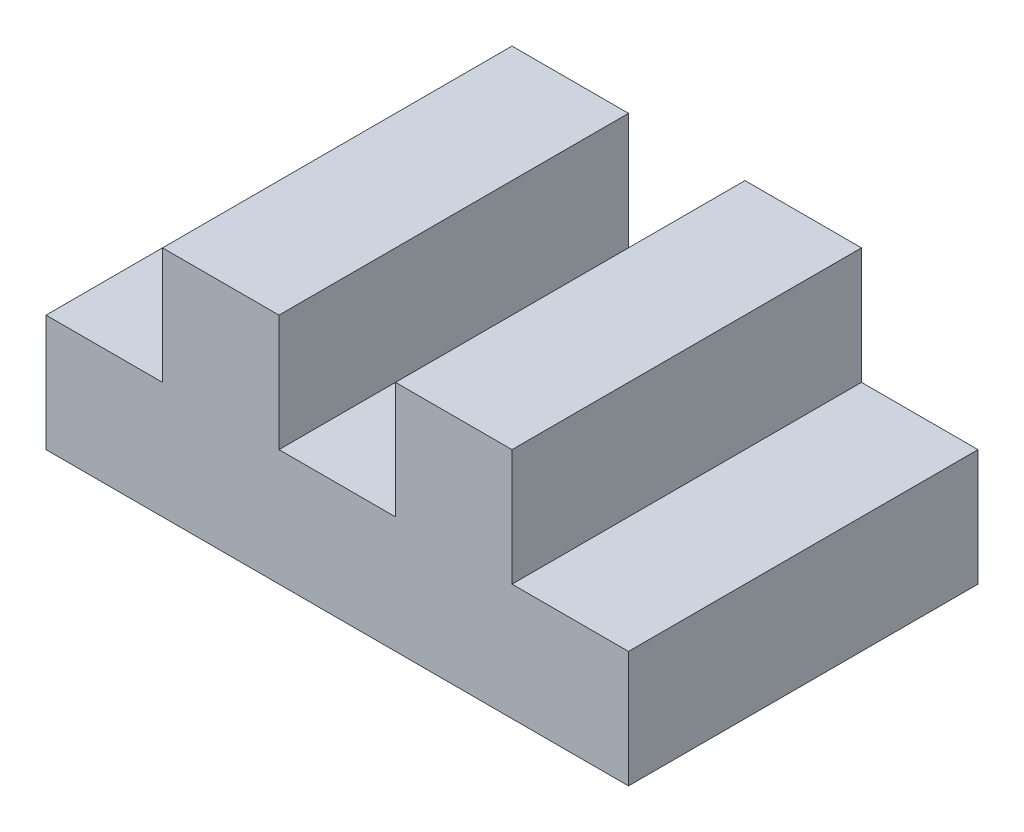
ISO-10303-21;
HEADER;
FILE_DESCRIPTION(('STEP AP214'),'2;1');
FILE_NAME('part.step','',(''),(''),'','','');
FILE_SCHEMA(('AUTOMOTIVE_DESIGN { 1 0 10303 214 1 1 1 1 }'));
ENDSEC;
DATA;
#1=APPLICATION_CONTEXT('core data for automotive mechanical design processes');
#2=APPLICATION_PROTOCOL_DEFINITION('international standard','automotive_design',2000,#1);
#3=PRODUCT_CONTEXT('',#1,'mechanical');
#4=PRODUCT('Part','Part','',(#3));
#5=PRODUCT_RELATED_PRODUCT_CATEGORY('part','',(#4));
#6=PRODUCT_DEFINITION_FORMATION('','',#4);
#7=PRODUCT_DEFINITION_CONTEXT('part definition',#1,'design');
#8=PRODUCT_DEFINITION('design','',#6,#7);
#9=PRODUCT_DEFINITION_SHAPE('','',#8);
#10=(LENGTH_UNIT() NAMED_UNIT(*) SI_UNIT(.MILLI.,.METRE.));
#11=(NAMED_UNIT(*) PLANE_ANGLE_UNIT() SI_UNIT($,.RADIAN.));
#12=(NAMED_UNIT(*) SI_UNIT($,.STERADIAN.) SOLID_ANGLE_UNIT());
#13=UNCERTAINTY_MEASURE_WITH_UNIT(LENGTH_MEASURE(1.E-05),#10,'distance_accuracy_value','');
#14=(GEOMETRIC_REPRESENTATION_CONTEXT(3) GLOBAL_UNCERTAINTY_ASSIGNED_CONTEXT((#13)) GLOBAL_UNIT_ASSIGNED_CONTEXT((#10,
#11,#12)) REPRESENTATION_CONTEXT('',''));
#15=CARTESIAN_POINT('',(0.,0.,0.));
#16=DIRECTION('',(0.,0.,1.));
#17=DIRECTION('',(1.,0.,0.));
#18=AXIS2_PLACEMENT_3D('',#15,#16,#17);
#19=CARTESIAN_POINT('',(0.,10.,30.));
#20=DIRECTION('',(1.,0.,0.));
#21=DIRECTION('',(0.,1.,0.));
#22=AXIS2_PLACEMENT_3D('',#19,#20,#21);
#23=PLANE('',#22);
#24=DIRECTION('',(0.,-1.,0.));
#25=VECTOR('',#24,1.);
#26=CARTESIAN_POINT('',(0.,10.,0.));
#27=LINE('',#26,#25);
#28=CARTESIAN_POINT('',(0.,10.,0.));
#29=VERTEX_POINT('',#28);
#30=CARTESIAN_POINT('',(0.,0.,0.));
#31=VERTEX_POINT('',#30);
#32=EDGE_CURVE('E153',#29,#31,#27,.T.);
#33=ORIENTED_EDGE('',*,*,#32,.T.);
#34=DIRECTION('',(0.,0.,-1.));
#35=VECTOR('',#34,1.);
#36=CARTESIAN_POINT('',(0.,0.,30.));
#37=LINE('',#36,#35);
#38=CARTESIAN_POINT('',(0.,0.,30.));
#39=VERTEX_POINT('',#38);
#40=EDGE_CURVE('E11',#39,#31,#37,.T.);
#41=ORIENTED_EDGE('',*,*,#40,.F.);
#42=DIRECTION('',(0.,-1.,0.));
#43=VECTOR('',#42,1.);
#44=CARTESIAN_POINT('',(0.,10.,30.));
#45=LINE('',#44,#43);
#46=CARTESIAN_POINT('',(0.,10.,30.));
#47=VERTEX_POINT('',#46);
#48=EDGE_CURVE('E175',#47,#39,#45,.T.);
#49=ORIENTED_EDGE('',*,*,#48,.F.);
#50=DIRECTION('',(0.,0.,-1.));
#51=VECTOR('',#50,1.);
#52=CARTESIAN_POINT('',(0.,10.,30.));
#53=LINE('',#52,#51);
#54=EDGE_CURVE('E149',#47,#29,#53,.T.);
#55=ORIENTED_EDGE('',*,*,#54,.T.);
#56=EDGE_LOOP('',(#33,#41,#49,#55));
#57=FACE_BOUND('',#56,.T.);
#58=ADVANCED_FACE('F33',(#57),#23,.F.);
#59=CARTESIAN_POINT('',(0.,0.,30.));
#60=DIRECTION('',(0.,1.,0.));
#61=DIRECTION('',(0.,0.,1.));
#62=AXIS2_PLACEMENT_3D('',#59,#60,#61);
#63=PLANE('',#62);
#64=DIRECTION('',(1.,0.,0.));
#65=VECTOR('',#64,1.);
#66=CARTESIAN_POINT('',(0.,0.,0.));
#67=LINE('',#66,#65);
#68=CARTESIAN_POINT('',(50.,0.,0.));
#69=VERTEX_POINT('',#68);
#70=EDGE_CURVE('E156',#31,#69,#67,.T.);
#71=ORIENTED_EDGE('',*,*,#70,.T.);
#72=DIRECTION('',(0.,0.,-1.));
#73=VECTOR('',#72,1.);
#74=CARTESIAN_POINT('',(50.,0.,30.));
#75=LINE('',#74,#73);
#76=CARTESIAN_POINT('',(50.,0.,30.));
#77=VERTEX_POINT('',#76);
#78=EDGE_CURVE('E41',#77,#69,#75,.T.);
#79=ORIENTED_EDGE('',*,*,#78,.F.);
#80=DIRECTION('',(1.,0.,0.));
#81=VECTOR('',#80,1.);
#82=CARTESIAN_POINT('',(0.,0.,30.));
#83=LINE('',#82,#81);
#84=EDGE_CURVE('E104',#39,#77,#83,.T.);
#85=ORIENTED_EDGE('',*,*,#84,.F.);
#86=ORIENTED_EDGE('',*,*,#40,.T.);
#87=EDGE_LOOP('',(#71,#79,#85,#86));
#88=FACE_BOUND('',#87,.T.);
#89=ADVANCED_FACE('F253',(#88),#63,.F.);
#90=CARTESIAN_POINT('',(50.,0.,30.));
#91=DIRECTION('',(-1.,0.,0.));
#92=DIRECTION('',(0.,0.,1.));
#93=AXIS2_PLACEMENT_3D('',#90,#91,#92);
#94=PLANE('',#93);
#95=DIRECTION('',(0.,1.,0.));
#96=VECTOR('',#95,1.);
#97=CARTESIAN_POINT('',(50.,0.,0.));
#98=LINE('',#97,#96);
#99=CARTESIAN_POINT('',(50.,10.,0.));
#100=VERTEX_POINT('',#99);
#101=EDGE_CURVE('E158',#69,#100,#98,.T.);
#102=ORIENTED_EDGE('',*,*,#101,.T.);
#103=DIRECTION('',(0.,0.,-1.));
#104=VECTOR('',#103,1.);
#105=CARTESIAN_POINT('',(50.,10.,30.));
#106=LINE('',#105,#104);
#107=CARTESIAN_POINT('',(50.,10.,30.));
#108=VERTEX_POINT('',#107);
#109=EDGE_CURVE('E194',#108,#100,#106,.T.);
#110=ORIENTED_EDGE('',*,*,#109,.F.);
#111=DIRECTION('',(0.,1.,0.));
#112=VECTOR('',#111,1.);
#113=CARTESIAN_POINT('',(50.,0.,30.));
#114=LINE('',#113,#112);
#115=EDGE_CURVE('E202',#77,#108,#114,.T.);
#116=ORIENTED_EDGE('',*,*,#115,.F.);
#117=ORIENTED_EDGE('',*,*,#78,.T.);
#118=EDGE_LOOP('',(#102,#110,#116,#117));
#119=FACE_BOUND('',#118,.T.);
#120=ADVANCED_FACE('F200',(#119),#94,.F.);
#121=CARTESIAN_POINT('',(50.,10.,30.));
#122=DIRECTION('',(0.,-1.,0.));
#123=DIRECTION('',(0.,0.,-1.));
#124=AXIS2_PLACEMENT_3D('',#121,#122,#123);
#125=PLANE('',#124);
#126=DIRECTION('',(-1.,0.,0.));
#127=VECTOR('',#126,1.);
#128=CARTESIAN_POINT('',(50.,10.,0.));
#129=LINE('',#128,#127);
#130=CARTESIAN_POINT('',(40.,10.,0.));
#131=VERTEX_POINT('',#130);
#132=EDGE_CURVE('E160',#100,#131,#129,.T.);
#133=ORIENTED_EDGE('',*,*,#132,.T.);
#134=DIRECTION('',(0.,0.,-1.));
#135=VECTOR('',#134,1.);
#136=CARTESIAN_POINT('',(40.,10.,30.));
#137=LINE('',#136,#135);
#138=CARTESIAN_POINT('',(40.,10.,30.));
#139=VERTEX_POINT('',#138);
#140=EDGE_CURVE('E191',#139,#131,#137,.T.);
#141=ORIENTED_EDGE('',*,*,#140,.F.);
#142=DIRECTION('',(-1.,0.,0.));
#143=VECTOR('',#142,1.);
#144=CARTESIAN_POINT('',(50.,10.,30.));
#145=LINE('',#144,#143);
#146=EDGE_CURVE('E220',#108,#139,#145,.T.);
#147=ORIENTED_EDGE('',*,*,#146,.F.);
#148=ORIENTED_EDGE('',*,*,#109,.T.);
#149=EDGE_LOOP('',(#133,#141,#147,#148));
#150=FACE_BOUND('',#149,.T.);
#151=ADVANCED_FACE('F211',(#150),#125,.F.);
#152=CARTESIAN_POINT('',(40.,10.,30.));
#153=DIRECTION('',(-1.,0.,0.));
#154=DIRECTION('',(0.,0.,1.));
#155=AXIS2_PLACEMENT_3D('',#152,#153,#154);
#156=PLANE('',#155);
#157=DIRECTION('',(0.,1.,0.));
#158=VECTOR('',#157,1.);
#159=CARTESIAN_POINT('',(40.,10.,0.));
#160=LINE('',#159,#158);
#161=CARTESIAN_POINT('',(40.,20.,0.));
#162=VERTEX_POINT('',#161);
#163=EDGE_CURVE('E162',#131,#162,#160,.T.);
#164=ORIENTED_EDGE('',*,*,#163,.T.);
#165=DIRECTION('',(0.,0.,-1.));
#166=VECTOR('',#165,1.);
#167=CARTESIAN_POINT('',(40.,20.,30.));
#168=LINE('',#167,#166);
#169=CARTESIAN_POINT('',(40.,20.,30.));
#170=VERTEX_POINT('',#169);
#171=EDGE_CURVE('E188',#170,#162,#168,.T.);
#172=ORIENTED_EDGE('',*,*,#171,.F.);
#173=DIRECTION('',(0.,1.,0.));
#174=VECTOR('',#173,1.);
#175=CARTESIAN_POINT('',(40.,10.,30.));
#176=LINE('',#175,#174);
#177=EDGE_CURVE('E217',#139,#170,#176,.T.);
#178=ORIENTED_EDGE('',*,*,#177,.F.);
#179=ORIENTED_EDGE('',*,*,#140,.T.);
#180=EDGE_LOOP('',(#164,#172,#178,#179));
#181=FACE_BOUND('',#180,.T.);
#182=ADVANCED_FACE('F215',(#181),#156,.F.);
#183=CARTESIAN_POINT('',(40.,20.,30.));
#184=DIRECTION('',(0.,-1.,0.));
#185=DIRECTION('',(1.,0.,0.));
#186=AXIS2_PLACEMENT_3D('',#183,#184,#185);
#187=PLANE('',#186);
#188=DIRECTION('',(-1.,0.,0.));
#189=VECTOR('',#188,1.);
#190=CARTESIAN_POINT('',(40.,20.,0.));
#191=LINE('',#190,#189);
#192=CARTESIAN_POINT('',(30.,20.,0.));
#193=VERTEX_POINT('',#192);
#194=EDGE_CURVE('E164',#162,#193,#191,.T.);
#195=ORIENTED_EDGE('',*,*,#194,.T.);
#196=DIRECTION('',(0.,0.,-1.));
#197=VECTOR('',#196,1.);
#198=CARTESIAN_POINT('',(30.,20.,30.));
#199=LINE('',#198,#197);
#200=CARTESIAN_POINT('',(30.,20.,30.));
#201=VERTEX_POINT('',#200);
#202=EDGE_CURVE('E185',#201,#193,#199,.T.);
#203=ORIENTED_EDGE('',*,*,#202,.F.);
#204=DIRECTION('',(-1.,0.,0.));
#205=VECTOR('',#204,1.);
#206=CARTESIAN_POINT('',(40.,20.,30.));
#207=LINE('',#206,#205);
#208=EDGE_CURVE('E219',#170,#201,#207,.T.);
#209=ORIENTED_EDGE('',*,*,#208,.F.);
#210=ORIENTED_EDGE('',*,*,#171,.T.);
#211=EDGE_LOOP('',(#195,#203,#209,#210));
#212=FACE_BOUND('',#211,.T.);
#213=ADVANCED_FACE('F266',(#212),#187,.F.);
#214=CARTESIAN_POINT('',(30.,20.,30.));
#215=DIRECTION('',(1.,0.,0.));
#216=DIRECTION('',(0.,0.,-1.));
#217=AXIS2_PLACEMENT_3D('',#214,#215,#216);
#218=PLANE('',#217);
#219=DIRECTION('',(0.,-1.,0.));
#220=VECTOR('',#219,1.);
#221=CARTESIAN_POINT('',(30.,20.,0.));
#222=LINE('',#221,#220);
#223=CARTESIAN_POINT('',(30.,10.,0.));
#224=VERTEX_POINT('',#223);
#225=EDGE_CURVE('E166',#193,#224,#222,.T.);
#226=ORIENTED_EDGE('',*,*,#225,.T.);
#227=DIRECTION('',(0.,0.,-1.));
#228=VECTOR('',#227,1.);
#229=CARTESIAN_POINT('',(30.,10.,30.));
#230=LINE('',#229,#228);
#231=CARTESIAN_POINT('',(30.,10.,30.));
#232=VERTEX_POINT('',#231);
#233=EDGE_CURVE('E182',#232,#224,#230,.T.);
#234=ORIENTED_EDGE('',*,*,#233,.F.);
#235=DIRECTION('',(0.,-1.,0.));
#236=VECTOR('',#235,1.);
#237=CARTESIAN_POINT('',(30.,20.,30.));
#238=LINE('',#237,#236);
#239=EDGE_CURVE('E222',#201,#232,#238,.T.);
#240=ORIENTED_EDGE('',*,*,#239,.F.);
#241=ORIENTED_EDGE('',*,*,#202,.T.);
#242=EDGE_LOOP('',(#226,#234,#240,#241));
#243=FACE_BOUND('',#242,.T.);
#244=ADVANCED_FACE('F269',(#243),#218,.F.);
#245=CARTESIAN_POINT('',(30.,10.,30.));
#246=DIRECTION('',(0.,-1.,0.));
#247=DIRECTION('',(1.,0.,0.));
#248=AXIS2_PLACEMENT_3D('',#245,#246,#247);
#249=PLANE('',#248);
#250=DIRECTION('',(-1.,0.,0.));
#251=VECTOR('',#250,1.);
#252=CARTESIAN_POINT('',(30.,10.,0.));
#253=LINE('',#252,#251);
#254=CARTESIAN_POINT('',(20.,10.,0.));
#255=VERTEX_POINT('',#254);
#256=EDGE_CURVE('E168',#224,#255,#253,.T.);
#257=ORIENTED_EDGE('',*,*,#256,.T.);
#258=DIRECTION('',(0.,0.,-1.));
#259=VECTOR('',#258,1.);
#260=CARTESIAN_POINT('',(20.,10.,30.));
#261=LINE('',#260,#259);
#262=CARTESIAN_POINT('',(20.,10.,30.));
#263=VERTEX_POINT('',#262);
#264=EDGE_CURVE('E179',#263,#255,#261,.T.);
#265=ORIENTED_EDGE('',*,*,#264,.F.);
#266=DIRECTION('',(-1.,0.,0.));
#267=VECTOR('',#266,1.);
#268=CARTESIAN_POINT('',(30.,10.,30.));
#269=LINE('',#268,#267);
#270=EDGE_CURVE('E228',#232,#263,#269,.T.);
#271=ORIENTED_EDGE('',*,*,#270,.F.);
#272=ORIENTED_EDGE('',*,*,#233,.T.);
#273=EDGE_LOOP('',(#257,#265,#271,#272));
#274=FACE_BOUND('',#273,.T.);
#275=ADVANCED_FACE('F234',(#274),#249,.F.);
#276=CARTESIAN_POINT('',(20.,10.,30.));
#277=DIRECTION('',(-1.,0.,0.));
#278=DIRECTION('',(0.,-1.,0.));
#279=AXIS2_PLACEMENT_3D('',#276,#277,#278);
#280=PLANE('',#279);
#281=DIRECTION('',(0.,1.,0.));
#282=VECTOR('',#281,1.);
#283=CARTESIAN_POINT('',(20.,10.,0.));
#284=LINE('',#283,#282);
#285=CARTESIAN_POINT('',(20.,20.,0.));
#286=VERTEX_POINT('',#285);
#287=EDGE_CURVE('E170',#255,#286,#284,.T.);
#288=ORIENTED_EDGE('',*,*,#287,.T.);
#289=DIRECTION('',(0.,0.,-1.));
#290=VECTOR('',#289,1.);
#291=CARTESIAN_POINT('',(20.,20.,30.));
#292=LINE('',#291,#290);
#293=CARTESIAN_POINT('',(20.,20.,30.));
#294=VERTEX_POINT('',#293);
#295=EDGE_CURVE('E144',#294,#286,#292,.T.);
#296=ORIENTED_EDGE('',*,*,#295,.F.);
#297=DIRECTION('',(0.,1.,0.));
#298=VECTOR('',#297,1.);
#299=CARTESIAN_POINT('',(20.,10.,30.));
#300=LINE('',#299,#298);
#301=EDGE_CURVE('E135',#263,#294,#300,.T.);
#302=ORIENTED_EDGE('',*,*,#301,.F.);
#303=ORIENTED_EDGE('',*,*,#264,.T.);
#304=EDGE_LOOP('',(#288,#296,#302,#303));
#305=FACE_BOUND('',#304,.T.);
#306=ADVANCED_FACE('F238',(#305),#280,.F.);
#307=CARTESIAN_POINT('',(20.,20.,30.));
#308=DIRECTION('',(0.,-1.,0.));
#309=DIRECTION('',(0.,0.,-1.));
#310=AXIS2_PLACEMENT_3D('',#307,#308,#309);
#311=PLANE('',#310);
#312=DIRECTION('',(-1.,0.,0.));
#313=VECTOR('',#312,1.);
#314=CARTESIAN_POINT('',(20.,20.,0.));
#315=LINE('',#314,#313);
#316=CARTESIAN_POINT('',(10.,20.,0.));
#317=VERTEX_POINT('',#316);
#318=EDGE_CURVE('E143',#286,#317,#315,.T.);
#319=ORIENTED_EDGE('',*,*,#318,.T.);
#320=DIRECTION('',(0.,0.,-1.));
#321=VECTOR('',#320,1.);
#322=CARTESIAN_POINT('',(10.,20.,30.));
#323=LINE('',#322,#321);
#324=CARTESIAN_POINT('',(10.,20.,30.));
#325=VERTEX_POINT('',#324);
#326=EDGE_CURVE('E140',#325,#317,#323,.T.);
#327=ORIENTED_EDGE('',*,*,#326,.F.);
#328=DIRECTION('',(-1.,0.,0.));
#329=VECTOR('',#328,1.);
#330=CARTESIAN_POINT('',(20.,20.,30.));
#331=LINE('',#330,#329);
#332=EDGE_CURVE('E129',#294,#325,#331,.T.);
#333=ORIENTED_EDGE('',*,*,#332,.F.);
#334=ORIENTED_EDGE('',*,*,#295,.T.);
#335=EDGE_LOOP('',(#319,#327,#333,#334));
#336=FACE_BOUND('',#335,.T.);
#337=ADVANCED_FACE('F141',(#336),#311,.F.);
#338=CARTESIAN_POINT('',(10.,20.,30.));
#339=DIRECTION('',(1.,0.,0.));
#340=DIRECTION('',(0.,1.,0.));
#341=AXIS2_PLACEMENT_3D('',#338,#339,#340);
#342=PLANE('',#341);
#343=DIRECTION('',(0.,-1.,0.));
#344=VECTOR('',#343,1.);
#345=CARTESIAN_POINT('',(10.,20.,0.));
#346=LINE('',#345,#344);
#347=CARTESIAN_POINT('',(10.,10.,0.));
#348=VERTEX_POINT('',#347);
#349=EDGE_CURVE('E90',#317,#348,#346,.T.);
#350=ORIENTED_EDGE('',*,*,#349,.T.);
#351=DIRECTION('',(0.,0.,-1.));
#352=VECTOR('',#351,1.);
#353=CARTESIAN_POINT('',(10.,10.,30.));
#354=LINE('',#353,#352);
#355=CARTESIAN_POINT('',(10.,10.,30.));
#356=VERTEX_POINT('',#355);
#357=EDGE_CURVE('E145',#356,#348,#354,.T.);
#358=ORIENTED_EDGE('',*,*,#357,.F.);
#359=DIRECTION('',(0.,-1.,0.));
#360=VECTOR('',#359,1.);
#361=CARTESIAN_POINT('',(10.,20.,30.));
#362=LINE('',#361,#360);
#363=EDGE_CURVE('E133',#325,#356,#362,.T.);
#364=ORIENTED_EDGE('',*,*,#363,.F.);
#365=ORIENTED_EDGE('',*,*,#326,.T.);
#366=EDGE_LOOP('',(#350,#358,#364,#365));
#367=FACE_BOUND('',#366,.T.);
#368=ADVANCED_FACE('F147',(#367),#342,.F.);
#369=CARTESIAN_POINT('',(10.,10.,30.));
#370=DIRECTION('',(0.,-1.,0.));
#371=DIRECTION('',(1.,0.,0.));
#372=AXIS2_PLACEMENT_3D('',#369,#370,#371);
#373=PLANE('',#372);
#374=DIRECTION('',(-1.,0.,0.));
#375=VECTOR('',#374,1.);
#376=CARTESIAN_POINT('',(10.,10.,0.));
#377=LINE('',#376,#375);
#378=EDGE_CURVE('E96',#348,#29,#377,.T.);
#379=ORIENTED_EDGE('',*,*,#378,.T.);
#380=ORIENTED_EDGE('',*,*,#54,.F.);
#381=DIRECTION('',(-1.,0.,0.));
#382=VECTOR('',#381,1.);
#383=CARTESIAN_POINT('',(10.,10.,30.));
#384=LINE('',#383,#382);
#385=EDGE_CURVE('E49',#356,#47,#384,.T.);
#386=ORIENTED_EDGE('',*,*,#385,.F.);
#387=ORIENTED_EDGE('',*,*,#357,.T.);
#388=EDGE_LOOP('',(#379,#380,#386,#387));
#389=FACE_BOUND('',#388,.T.);
#390=ADVANCED_FACE('F242',(#389),#373,.F.);
#391=CARTESIAN_POINT('',(0.,0.,30.));
#392=DIRECTION('',(0.,0.,1.));
#393=DIRECTION('',(1.,0.,0.));
#394=AXIS2_PLACEMENT_3D('',#391,#392,#393);
#395=PLANE('',#394);
#396=ORIENTED_EDGE('',*,*,#48,.T.);
#397=ORIENTED_EDGE('',*,*,#84,.T.);
#398=ORIENTED_EDGE('',*,*,#115,.T.);
#399=ORIENTED_EDGE('',*,*,#146,.T.);
#400=ORIENTED_EDGE('',*,*,#177,.T.);
#401=ORIENTED_EDGE('',*,*,#208,.T.);
#402=ORIENTED_EDGE('',*,*,#239,.T.);
#403=ORIENTED_EDGE('',*,*,#270,.T.);
#404=ORIENTED_EDGE('',*,*,#301,.T.);
#405=ORIENTED_EDGE('',*,*,#332,.T.);
#406=ORIENTED_EDGE('',*,*,#363,.T.);
#407=ORIENTED_EDGE('',*,*,#385,.T.);
#408=EDGE_LOOP('',(#396,#397,#398,#399,#400,#401,#402,#403,#404,#405,#406,#407));
#409=FACE_BOUND('',#408,.T.);
#410=ADVANCED_FACE('F131',(#409),#395,.T.);
#411=CARTESIAN_POINT('',(0.,0.,0.));
#412=DIRECTION('',(0.,0.,1.));
#413=DIRECTION('',(1.,0.,0.));
#414=AXIS2_PLACEMENT_3D('',#411,#412,#413);
#415=PLANE('',#414);
#416=ORIENTED_EDGE('',*,*,#32,.F.);
#417=ORIENTED_EDGE('',*,*,#378,.F.);
#418=ORIENTED_EDGE('',*,*,#349,.F.);
#419=ORIENTED_EDGE('',*,*,#318,.F.);
#420=ORIENTED_EDGE('',*,*,#287,.F.);
#421=ORIENTED_EDGE('',*,*,#256,.F.);
#422=ORIENTED_EDGE('',*,*,#225,.F.);
#423=ORIENTED_EDGE('',*,*,#194,.F.);
#424=ORIENTED_EDGE('',*,*,#163,.F.);
#425=ORIENTED_EDGE('',*,*,#132,.F.);
#426=ORIENTED_EDGE('',*,*,#101,.F.);
#427=ORIENTED_EDGE('',*,*,#70,.F.);
#428=EDGE_LOOP('',(#416,#417,#418,#419,#420,#421,#422,#423,#424,#425,#426,#427));
#429=FACE_BOUND('',#428,.T.);
#430=ADVANCED_FACE('F206',(#429),#415,.F.);
#431=CLOSED_SHELL('',(#58,#89,#120,#151,#182,#213,#244,#275,#306,#337,#368,#390,#410,#430));
#432=MANIFOLD_SOLID_BREP('B2',#431);
#433=ADVANCED_BREP_SHAPE_REPRESENTATION('',(#18,#432),#14);
#434=SHAPE_DEFINITION_REPRESENTATION(#9,#433);
ENDSEC;
END-ISO-10303-21;
